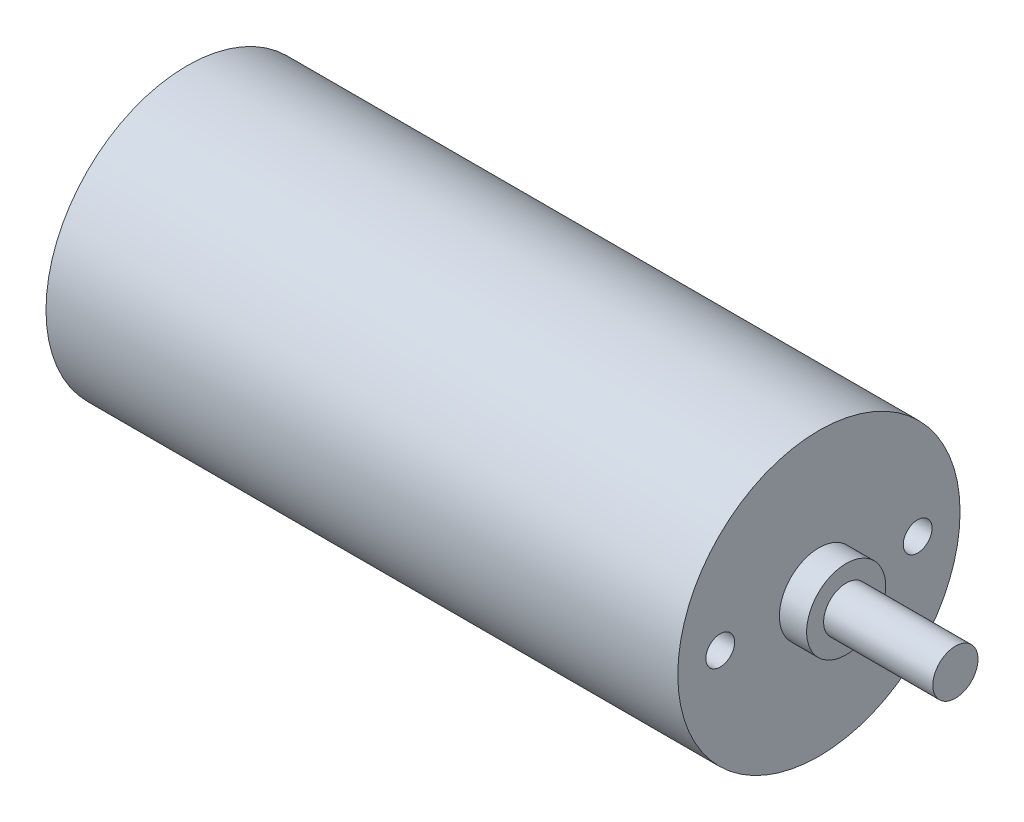
ISO-10303-21;
HEADER;
FILE_DESCRIPTION(('STEP AP214'),'2;1');
FILE_NAME('part.step','',(''),(''),'','','');
FILE_SCHEMA(('AUTOMOTIVE_DESIGN { 1 0 10303 214 1 1 1 1 }'));
ENDSEC;
DATA;
#1=APPLICATION_CONTEXT('core data for automotive mechanical design processes');
#2=APPLICATION_PROTOCOL_DEFINITION('international standard','automotive_design',2000,#1);
#3=PRODUCT_CONTEXT('',#1,'mechanical');
#4=PRODUCT('Part','Part','',(#3));
#5=PRODUCT_RELATED_PRODUCT_CATEGORY('part','',(#4));
#6=PRODUCT_DEFINITION_FORMATION('','',#4);
#7=PRODUCT_DEFINITION_CONTEXT('part definition',#1,'design');
#8=PRODUCT_DEFINITION('design','',#6,#7);
#9=PRODUCT_DEFINITION_SHAPE('','',#8);
#10=(LENGTH_UNIT() NAMED_UNIT(*) SI_UNIT(.MILLI.,.METRE.));
#11=(NAMED_UNIT(*) PLANE_ANGLE_UNIT() SI_UNIT($,.RADIAN.));
#12=(NAMED_UNIT(*) SI_UNIT($,.STERADIAN.) SOLID_ANGLE_UNIT());
#13=UNCERTAINTY_MEASURE_WITH_UNIT(LENGTH_MEASURE(1.E-05),#10,'distance_accuracy_value','');
#14=(GEOMETRIC_REPRESENTATION_CONTEXT(3) GLOBAL_UNCERTAINTY_ASSIGNED_CONTEXT((#13)) GLOBAL_UNIT_ASSIGNED_CONTEXT((#10,
#11,#12)) REPRESENTATION_CONTEXT('',''));
#15=CARTESIAN_POINT('',(0.,0.,0.));
#16=DIRECTION('',(0.,0.,1.));
#17=DIRECTION('',(1.,0.,0.));
#18=AXIS2_PLACEMENT_3D('',#15,#16,#17);
#19=CARTESIAN_POINT('',(-55.69,0.,8.7));
#20=DIRECTION('',(1.,0.,0.));
#21=DIRECTION('',(0.,0.,-1.));
#22=AXIS2_PLACEMENT_3D('',#19,#20,#21);
#23=CYLINDRICAL_SURFACE('',#22,1.27);
#24=CARTESIAN_POINT('',(-55.69,0.,8.7));
#25=DIRECTION('',(1.,0.,0.));
#26=DIRECTION('',(0.,0.,-1.));
#27=AXIS2_PLACEMENT_3D('',#24,#25,#26);
#28=CIRCLE('',#27,1.27);
#29=CARTESIAN_POINT('',(-55.69,0.,7.43));
#30=VERTEX_POINT('',#29);
#31=EDGE_CURVE('E50',#30,#30,#28,.T.);
#32=ORIENTED_EDGE('',*,*,#31,.F.);
#33=EDGE_LOOP('',(#32));
#34=FACE_BOUND('',#33,.T.);
#35=CARTESIAN_POINT('',(0.,0.,8.7));
#36=DIRECTION('',(1.,0.,0.));
#37=DIRECTION('',(0.,0.,-1.));
#38=AXIS2_PLACEMENT_3D('',#35,#36,#37);
#39=CIRCLE('',#38,1.27);
#40=CARTESIAN_POINT('',(0.,0.,7.43));
#41=VERTEX_POINT('',#40);
#42=EDGE_CURVE('E64',#41,#41,#39,.T.);
#43=ORIENTED_EDGE('',*,*,#42,.T.);
#44=EDGE_LOOP('',(#43));
#45=FACE_BOUND('',#44,.T.);
#46=ADVANCED_FACE('F42',(#34,#45),#23,.F.);
#47=CARTESIAN_POINT('',(-55.69,0.,0.));
#48=DIRECTION('',(1.,0.,0.));
#49=DIRECTION('',(0.,0.,-1.));
#50=AXIS2_PLACEMENT_3D('',#47,#48,#49);
#51=CYLINDRICAL_SURFACE('',#50,3.485);
#52=CARTESIAN_POINT('',(-55.69,0.,0.));
#53=DIRECTION('',(1.,0.,0.));
#54=DIRECTION('',(0.,0.,-1.));
#55=AXIS2_PLACEMENT_3D('',#52,#53,#54);
#56=CIRCLE('',#55,3.485);
#57=CARTESIAN_POINT('',(-55.69,0.,-3.485));
#58=VERTEX_POINT('',#57);
#59=EDGE_CURVE('E55',#58,#58,#56,.T.);
#60=ORIENTED_EDGE('',*,*,#59,.F.);
#61=EDGE_LOOP('',(#60));
#62=FACE_BOUND('',#61,.T.);
#63=CARTESIAN_POINT('',(0.,0.,0.));
#64=DIRECTION('',(1.,0.,0.));
#65=DIRECTION('',(0.,0.,-1.));
#66=AXIS2_PLACEMENT_3D('',#63,#64,#65);
#67=CIRCLE('',#66,3.485);
#68=CARTESIAN_POINT('',(0.,0.,-3.485));
#69=VERTEX_POINT('',#68);
#70=EDGE_CURVE('E62',#69,#69,#67,.T.);
#71=ORIENTED_EDGE('',*,*,#70,.T.);
#72=EDGE_LOOP('',(#71));
#73=FACE_BOUND('',#72,.T.);
#74=ADVANCED_FACE('F82',(#62,#73),#51,.F.);
#75=CARTESIAN_POINT('',(-55.69,0.,0.));
#76=DIRECTION('',(1.,0.,0.));
#77=DIRECTION('',(0.,0.,-1.));
#78=AXIS2_PLACEMENT_3D('',#75,#76,#77);
#79=CYLINDRICAL_SURFACE('',#78,12.44);
#80=CARTESIAN_POINT('',(-55.69,0.,0.));
#81=DIRECTION('',(1.,0.,0.));
#82=DIRECTION('',(0.,0.,-1.));
#83=AXIS2_PLACEMENT_3D('',#80,#81,#82);
#84=CIRCLE('',#83,12.44);
#85=CARTESIAN_POINT('',(-55.69,0.,-12.44));
#86=VERTEX_POINT('',#85);
#87=EDGE_CURVE('E69',#86,#86,#84,.T.);
#88=ORIENTED_EDGE('',*,*,#87,.T.);
#89=EDGE_LOOP('',(#88));
#90=FACE_BOUND('',#89,.T.);
#91=CARTESIAN_POINT('',(0.,0.,0.));
#92=DIRECTION('',(1.,0.,0.));
#93=DIRECTION('',(0.,0.,-1.));
#94=AXIS2_PLACEMENT_3D('',#91,#92,#93);
#95=CIRCLE('',#94,12.44);
#96=CARTESIAN_POINT('',(0.,0.,-12.44));
#97=VERTEX_POINT('',#96);
#98=EDGE_CURVE('E59',#97,#97,#95,.T.);
#99=ORIENTED_EDGE('',*,*,#98,.F.);
#100=EDGE_LOOP('',(#99));
#101=FACE_BOUND('',#100,.T.);
#102=ADVANCED_FACE('F44',(#90,#101),#79,.T.);
#103=CARTESIAN_POINT('',(-55.69,0.,-8.7));
#104=DIRECTION('',(1.,0.,0.));
#105=DIRECTION('',(0.,0.,-1.));
#106=AXIS2_PLACEMENT_3D('',#103,#104,#105);
#107=CYLINDRICAL_SURFACE('',#106,1.27);
#108=CARTESIAN_POINT('',(-55.69,0.,-8.7));
#109=DIRECTION('',(1.,0.,0.));
#110=DIRECTION('',(0.,0.,-1.));
#111=AXIS2_PLACEMENT_3D('',#108,#109,#110);
#112=CIRCLE('',#111,1.27);
#113=CARTESIAN_POINT('',(-55.69,0.,-9.97));
#114=VERTEX_POINT('',#113);
#115=EDGE_CURVE('E11',#114,#114,#112,.F.);
#116=ORIENTED_EDGE('',*,*,#115,.T.);
#117=EDGE_LOOP('',(#116));
#118=FACE_BOUND('',#117,.T.);
#119=CARTESIAN_POINT('',(0.,0.,-8.7));
#120=DIRECTION('',(1.,0.,0.));
#121=DIRECTION('',(0.,0.,-1.));
#122=AXIS2_PLACEMENT_3D('',#119,#120,#121);
#123=CIRCLE('',#122,1.27);
#124=CARTESIAN_POINT('',(0.,0.,-9.97));
#125=VERTEX_POINT('',#124);
#126=EDGE_CURVE('E46',#125,#125,#123,.F.);
#127=ORIENTED_EDGE('',*,*,#126,.F.);
#128=EDGE_LOOP('',(#127));
#129=FACE_BOUND('',#128,.T.);
#130=ADVANCED_FACE('F95',(#118,#129),#107,.F.);
#131=CARTESIAN_POINT('',(-55.69,0.,0.));
#132=DIRECTION('',(1.,0.,0.));
#133=DIRECTION('',(0.,0.,-1.));
#134=AXIS2_PLACEMENT_3D('',#131,#132,#133);
#135=PLANE('',#134);
#136=ORIENTED_EDGE('',*,*,#87,.F.);
#137=EDGE_LOOP('',(#136));
#138=FACE_BOUND('',#137,.T.);
#139=ORIENTED_EDGE('',*,*,#59,.T.);
#140=EDGE_LOOP('',(#139));
#141=FACE_BOUND('',#140,.T.);
#142=ORIENTED_EDGE('',*,*,#31,.T.);
#143=EDGE_LOOP('',(#142));
#144=FACE_BOUND('',#143,.T.);
#145=ORIENTED_EDGE('',*,*,#115,.F.);
#146=EDGE_LOOP('',(#145));
#147=FACE_BOUND('',#146,.T.);
#148=ADVANCED_FACE('F79',(#138,#141,#144,#147),#135,.F.);
#149=CARTESIAN_POINT('',(0.,0.,0.));
#150=DIRECTION('',(1.,0.,0.));
#151=DIRECTION('',(0.,0.,-1.));
#152=AXIS2_PLACEMENT_3D('',#149,#150,#151);
#153=PLANE('',#152);
#154=ORIENTED_EDGE('',*,*,#98,.T.);
#155=EDGE_LOOP('',(#154));
#156=FACE_BOUND('',#155,.T.);
#157=ORIENTED_EDGE('',*,*,#70,.F.);
#158=EDGE_LOOP('',(#157));
#159=FACE_BOUND('',#158,.T.);
#160=ORIENTED_EDGE('',*,*,#42,.F.);
#161=EDGE_LOOP('',(#160));
#162=FACE_BOUND('',#161,.T.);
#163=ORIENTED_EDGE('',*,*,#126,.T.);
#164=EDGE_LOOP('',(#163));
#165=FACE_BOUND('',#164,.T.);
#166=ADVANCED_FACE('F87',(#156,#159,#162,#165),#153,.T.);
#167=CLOSED_SHELL('',(#46,#74,#102,#130,#148,#166));
#168=MANIFOLD_SOLID_BREP('B2',#167);
#169=CARTESIAN_POINT('',(12.03,0.,0.));
#170=DIRECTION('',(-1.,0.,0.));
#171=DIRECTION('',(0.,0.,1.));
#172=AXIS2_PLACEMENT_3D('',#169,#170,#171);
#173=CYLINDRICAL_SURFACE('',#172,1.99);
#174=CARTESIAN_POINT('',(2.4,0.,0.));
#175=DIRECTION('',(1.,0.,0.));
#176=DIRECTION('',(0.,0.,-1.));
#177=AXIS2_PLACEMENT_3D('',#174,#175,#176);
#178=CIRCLE('',#177,1.99);
#179=CARTESIAN_POINT('',(2.4,0.,-1.99));
#180=VERTEX_POINT('',#179);
#181=EDGE_CURVE('E155',#180,#180,#178,.T.);
#182=ORIENTED_EDGE('',*,*,#181,.T.);
#183=EDGE_LOOP('',(#182));
#184=FACE_BOUND('',#183,.T.);
#185=CARTESIAN_POINT('',(12.03,0.,0.));
#186=DIRECTION('',(1.,0.,0.));
#187=DIRECTION('',(0.,0.,-1.));
#188=AXIS2_PLACEMENT_3D('',#185,#186,#187);
#189=CIRCLE('',#188,1.99);
#190=CARTESIAN_POINT('',(12.03,0.,-1.99));
#191=VERTEX_POINT('',#190);
#192=EDGE_CURVE('E41',#191,#191,#189,.T.);
#193=ORIENTED_EDGE('',*,*,#192,.F.);
#194=EDGE_LOOP('',(#193));
#195=FACE_BOUND('',#194,.T.);
#196=ADVANCED_FACE('F145',(#184,#195),#173,.T.);
#197=CARTESIAN_POINT('',(12.03,0.,0.));
#198=DIRECTION('',(1.,0.,0.));
#199=DIRECTION('',(0.,0.,-1.));
#200=AXIS2_PLACEMENT_3D('',#197,#198,#199);
#201=PLANE('',#200);
#202=ORIENTED_EDGE('',*,*,#192,.T.);
#203=EDGE_LOOP('',(#202));
#204=FACE_BOUND('',#203,.T.);
#205=ADVANCED_FACE('F177',(#204),#201,.T.);
#206=CARTESIAN_POINT('',(2.4,0.,0.));
#207=DIRECTION('',(-1.,0.,0.));
#208=DIRECTION('',(0.,0.,1.));
#209=AXIS2_PLACEMENT_3D('',#206,#207,#208);
#210=CYLINDRICAL_SURFACE('',#209,3.485);
#211=CARTESIAN_POINT('',(2.4,0.,0.));
#212=DIRECTION('',(1.,0.,0.));
#213=DIRECTION('',(0.,0.,-1.));
#214=AXIS2_PLACEMENT_3D('',#211,#212,#213);
#215=CIRCLE('',#214,3.485);
#216=CARTESIAN_POINT('',(2.4,0.,-3.485));
#217=VERTEX_POINT('',#216);
#218=EDGE_CURVE('E151',#217,#217,#215,.T.);
#219=ORIENTED_EDGE('',*,*,#218,.F.);
#220=EDGE_LOOP('',(#219));
#221=FACE_BOUND('',#220,.T.);
#222=CARTESIAN_POINT('',(0.,0.,0.));
#223=DIRECTION('',(1.,0.,0.));
#224=DIRECTION('',(0.,0.,-1.));
#225=AXIS2_PLACEMENT_3D('',#222,#223,#224);
#226=CIRCLE('',#225,3.485);
#227=CARTESIAN_POINT('',(0.,0.,-3.485));
#228=VERTEX_POINT('',#227);
#229=EDGE_CURVE('E160',#228,#228,#226,.T.);
#230=ORIENTED_EDGE('',*,*,#229,.T.);
#231=EDGE_LOOP('',(#230));
#232=FACE_BOUND('',#231,.T.);
#233=ADVANCED_FACE('F165',(#221,#232),#210,.T.);
#234=CARTESIAN_POINT('',(2.4,0.,0.));
#235=DIRECTION('',(1.,0.,0.));
#236=DIRECTION('',(0.,0.,-1.));
#237=AXIS2_PLACEMENT_3D('',#234,#235,#236);
#238=PLANE('',#237);
#239=ORIENTED_EDGE('',*,*,#181,.F.);
#240=EDGE_LOOP('',(#239));
#241=FACE_BOUND('',#240,.T.);
#242=ORIENTED_EDGE('',*,*,#218,.T.);
#243=EDGE_LOOP('',(#242));
#244=FACE_BOUND('',#243,.T.);
#245=ADVANCED_FACE('F169',(#241,#244),#238,.T.);
#246=CARTESIAN_POINT('',(0.,0.,0.));
#247=DIRECTION('',(1.,0.,0.));
#248=DIRECTION('',(0.,0.,-1.));
#249=AXIS2_PLACEMENT_3D('',#246,#247,#248);
#250=PLANE('',#249);
#251=ORIENTED_EDGE('',*,*,#229,.F.);
#252=EDGE_LOOP('',(#251));
#253=FACE_BOUND('',#252,.T.);
#254=ADVANCED_FACE('F167',(#253),#250,.F.);
#255=CLOSED_SHELL('',(#196,#205,#233,#245,#254));
#256=MANIFOLD_SOLID_BREP('B6',#255);
#257=ADVANCED_BREP_SHAPE_REPRESENTATION('',(#18,#168,#256),#14);
#258=SHAPE_DEFINITION_REPRESENTATION(#9,#257);
ENDSEC;
END-ISO-10303-21;
